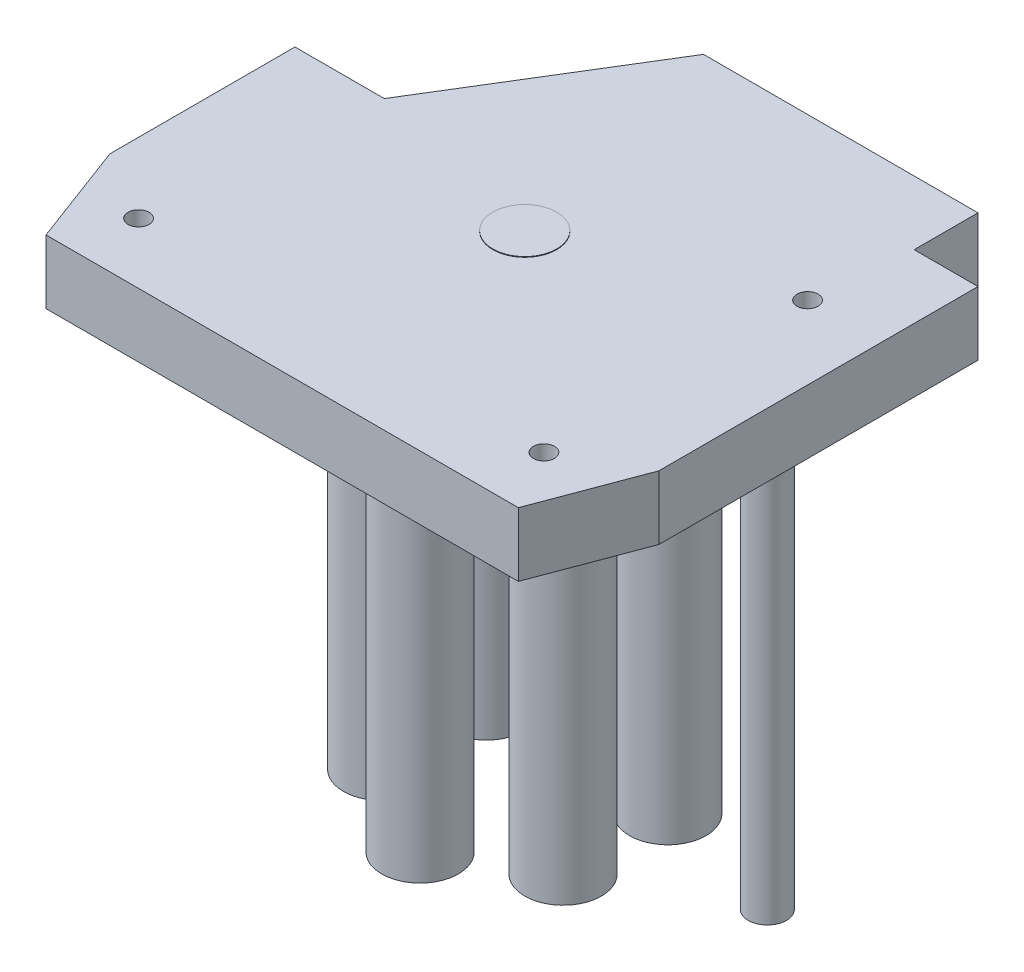
ISO-10303-21;
HEADER;
FILE_DESCRIPTION(('STEP AP214'),'2;1');
FILE_NAME('part.step','',(''),(''),'','','');
FILE_SCHEMA(('AUTOMOTIVE_DESIGN { 1 0 10303 214 1 1 1 1 }'));
ENDSEC;
DATA;
#1=APPLICATION_CONTEXT('core data for automotive mechanical design processes');
#2=APPLICATION_PROTOCOL_DEFINITION('international standard','automotive_design',2000,#1);
#3=PRODUCT_CONTEXT('',#1,'mechanical');
#4=PRODUCT('Part','Part','',(#3));
#5=PRODUCT_RELATED_PRODUCT_CATEGORY('part','',(#4));
#6=PRODUCT_DEFINITION_FORMATION('','',#4);
#7=PRODUCT_DEFINITION_CONTEXT('part definition',#1,'design');
#8=PRODUCT_DEFINITION('design','',#6,#7);
#9=PRODUCT_DEFINITION_SHAPE('','',#8);
#10=(LENGTH_UNIT() NAMED_UNIT(*) SI_UNIT(.MILLI.,.METRE.));
#11=(NAMED_UNIT(*) PLANE_ANGLE_UNIT() SI_UNIT($,.RADIAN.));
#12=(NAMED_UNIT(*) SI_UNIT($,.STERADIAN.) SOLID_ANGLE_UNIT());
#13=UNCERTAINTY_MEASURE_WITH_UNIT(LENGTH_MEASURE(1.E-05),#10,'distance_accuracy_value','');
#14=(GEOMETRIC_REPRESENTATION_CONTEXT(3) GLOBAL_UNCERTAINTY_ASSIGNED_CONTEXT((#13)) GLOBAL_UNIT_ASSIGNED_CONTEXT((#10,
#11,#12)) REPRESENTATION_CONTEXT('',''));
#15=CARTESIAN_POINT('',(0.,0.,0.));
#16=DIRECTION('',(0.,0.,1.));
#17=DIRECTION('',(1.,0.,0.));
#18=AXIS2_PLACEMENT_3D('',#15,#16,#17);
#19=CARTESIAN_POINT('',(14.,10.,0.));
#20=DIRECTION('',(0.,0.,1.));
#21=DIRECTION('',(1.,0.,0.));
#22=AXIS2_PLACEMENT_3D('',#19,#20,#21);
#23=PLANE('',#22);
#24=DIRECTION('',(-1.,0.,0.));
#25=VECTOR('',#24,1.);
#26=CARTESIAN_POINT('',(14.,0.,0.));
#27=LINE('',#26,#25);
#28=CARTESIAN_POINT('',(14.,0.,0.));
#29=VERTEX_POINT('',#28);
#30=CARTESIAN_POINT('',(0.,0.,0.));
#31=VERTEX_POINT('',#30);
#32=EDGE_CURVE('E224',#29,#31,#27,.T.);
#33=ORIENTED_EDGE('',*,*,#32,.T.);
#34=DIRECTION('',(0.,-1.,0.));
#35=VECTOR('',#34,1.);
#36=CARTESIAN_POINT('',(0.,10.,0.));
#37=LINE('',#36,#35);
#38=CARTESIAN_POINT('',(0.,10.,0.));
#39=VERTEX_POINT('',#38);
#40=EDGE_CURVE('E148',#39,#31,#37,.T.);
#41=ORIENTED_EDGE('',*,*,#40,.F.);
#42=DIRECTION('',(-1.,0.,0.));
#43=VECTOR('',#42,1.);
#44=CARTESIAN_POINT('',(14.,10.,0.));
#45=LINE('',#44,#43);
#46=CARTESIAN_POINT('',(14.,10.,0.));
#47=VERTEX_POINT('',#46);
#48=EDGE_CURVE('E135',#47,#39,#45,.T.);
#49=ORIENTED_EDGE('',*,*,#48,.F.);
#50=DIRECTION('',(0.,-1.,0.));
#51=VECTOR('',#50,1.);
#52=CARTESIAN_POINT('',(14.,10.,0.));
#53=LINE('',#52,#51);
#54=EDGE_CURVE('E142',#47,#29,#53,.T.);
#55=ORIENTED_EDGE('',*,*,#54,.T.);
#56=EDGE_LOOP('',(#33,#41,#49,#55));
#57=FACE_BOUND('',#56,.T.);
#58=ADVANCED_FACE('F33',(#57),#23,.F.);
#59=CARTESIAN_POINT('',(0.,10.,0.));
#60=DIRECTION('',(1.,0.,0.));
#61=DIRECTION('',(0.,0.,-1.));
#62=AXIS2_PLACEMENT_3D('',#59,#60,#61);
#63=PLANE('',#62);
#64=DIRECTION('',(0.,0.,1.));
#65=VECTOR('',#64,1.);
#66=CARTESIAN_POINT('',(0.,0.,0.));
#67=LINE('',#66,#65);
#68=CARTESIAN_POINT('',(0.,0.,28.9999999999999));
#69=VERTEX_POINT('',#68);
#70=EDGE_CURVE('E239',#31,#69,#67,.T.);
#71=ORIENTED_EDGE('',*,*,#70,.T.);
#72=DIRECTION('',(0.,1.,0.));
#73=VECTOR('',#72,1.);
#74=CARTESIAN_POINT('',(0.,10.,28.9999999999999));
#75=LINE('',#74,#73);
#76=CARTESIAN_POINT('',(0.,10.,28.9999999999999));
#77=VERTEX_POINT('',#76);
#78=EDGE_CURVE('E42',#69,#77,#75,.T.);
#79=ORIENTED_EDGE('',*,*,#78,.T.);
#80=DIRECTION('',(0.,0.,1.));
#81=VECTOR('',#80,1.);
#82=CARTESIAN_POINT('',(0.,10.,0.));
#83=LINE('',#82,#81);
#84=EDGE_CURVE('E228',#39,#77,#83,.T.);
#85=ORIENTED_EDGE('',*,*,#84,.F.);
#86=ORIENTED_EDGE('',*,*,#40,.T.);
#87=EDGE_LOOP('',(#71,#79,#85,#86));
#88=FACE_BOUND('',#87,.T.);
#89=ADVANCED_FACE('F267',(#88),#63,.F.);
#90=CARTESIAN_POINT('',(0.,10.,45.));
#91=DIRECTION('',(0.,0.,-1.));
#92=DIRECTION('',(-1.,0.,0.));
#93=AXIS2_PLACEMENT_3D('',#90,#91,#92);
#94=PLANE('',#93);
#95=DIRECTION('',(1.,0.,0.));
#96=VECTOR('',#95,1.);
#97=CARTESIAN_POINT('',(0.,10.,45.));
#98=LINE('',#97,#96);
#99=CARTESIAN_POINT('',(6.00000000000001,10.,45.));
#100=VERTEX_POINT('',#99);
#101=CARTESIAN_POINT('',(80.,10.,45.));
#102=VERTEX_POINT('',#101);
#103=EDGE_CURVE('E230',#100,#102,#98,.T.);
#104=ORIENTED_EDGE('',*,*,#103,.F.);
#105=DIRECTION('',(0.,-1.,0.));
#106=VECTOR('',#105,1.);
#107=CARTESIAN_POINT('',(6.00000000000001,10.,45.));
#108=LINE('',#107,#106);
#109=CARTESIAN_POINT('',(6.00000000000001,0.,45.));
#110=VERTEX_POINT('',#109);
#111=EDGE_CURVE('E162',#100,#110,#108,.T.);
#112=ORIENTED_EDGE('',*,*,#111,.T.);
#113=DIRECTION('',(1.,0.,0.));
#114=VECTOR('',#113,1.);
#115=CARTESIAN_POINT('',(0.,0.,45.));
#116=LINE('',#115,#114);
#117=CARTESIAN_POINT('',(80.,0.,45.));
#118=VERTEX_POINT('',#117);
#119=EDGE_CURVE('E138',#110,#118,#116,.T.);
#120=ORIENTED_EDGE('',*,*,#119,.T.);
#121=DIRECTION('',(0.,1.,0.));
#122=VECTOR('',#121,1.);
#123=CARTESIAN_POINT('',(80.,10.,45.));
#124=LINE('',#123,#122);
#125=EDGE_CURVE('E157',#118,#102,#124,.T.);
#126=ORIENTED_EDGE('',*,*,#125,.T.);
#127=EDGE_LOOP('',(#104,#112,#120,#126));
#128=FACE_BOUND('',#127,.T.);
#129=ADVANCED_FACE('F243',(#128),#94,.F.);
#130=CARTESIAN_POINT('',(86.,10.,45.));
#131=DIRECTION('',(-1.,0.,0.));
#132=DIRECTION('',(0.,0.,1.));
#133=AXIS2_PLACEMENT_3D('',#130,#131,#132);
#134=PLANE('',#133);
#135=DIRECTION('',(0.,0.,-1.));
#136=VECTOR('',#135,1.);
#137=CARTESIAN_POINT('',(86.,0.,45.));
#138=LINE('',#137,#136);
#139=CARTESIAN_POINT('',(86.,0.,28.9999999999998));
#140=VERTEX_POINT('',#139);
#141=CARTESIAN_POINT('',(86.,0.,-21.));
#142=VERTEX_POINT('',#141);
#143=EDGE_CURVE('E133',#140,#142,#138,.T.);
#144=ORIENTED_EDGE('',*,*,#143,.T.);
#145=DIRECTION('',(0.,1.,0.));
#146=VECTOR('',#145,1.);
#147=CARTESIAN_POINT('',(86.,0.,-21.));
#148=LINE('',#147,#146);
#149=CARTESIAN_POINT('',(86.,10.,-21.));
#150=VERTEX_POINT('',#149);
#151=EDGE_CURVE('E221',#142,#150,#148,.T.);
#152=ORIENTED_EDGE('',*,*,#151,.T.);
#153=DIRECTION('',(0.,0.,-1.));
#154=VECTOR('',#153,1.);
#155=CARTESIAN_POINT('',(86.,10.,45.));
#156=LINE('',#155,#154);
#157=CARTESIAN_POINT('',(86.,10.,28.9999999999998));
#158=VERTEX_POINT('',#157);
#159=EDGE_CURVE('E232',#158,#150,#156,.T.);
#160=ORIENTED_EDGE('',*,*,#159,.F.);
#161=DIRECTION('',(0.,-1.,0.));
#162=VECTOR('',#161,1.);
#163=CARTESIAN_POINT('',(86.,10.,28.9999999999998));
#164=LINE('',#163,#162);
#165=EDGE_CURVE('E151',#158,#140,#164,.T.);
#166=ORIENTED_EDGE('',*,*,#165,.T.);
#167=EDGE_LOOP('',(#144,#152,#160,#166));
#168=FACE_BOUND('',#167,.T.);
#169=ADVANCED_FACE('F256',(#168),#134,.F.);
#170=CARTESIAN_POINT('',(86.,10.,-31.));
#171=DIRECTION('',(0.,0.,1.));
#172=DIRECTION('',(1.,0.,0.));
#173=AXIS2_PLACEMENT_3D('',#170,#171,#172);
#174=PLANE('',#173);
#175=CARTESIAN_POINT('',(43.,5.,-31.));
#176=DIRECTION('',(0.,0.,-1.));
#177=DIRECTION('',(-1.,0.,0.));
#178=AXIS2_PLACEMENT_3D('',#175,#176,#177);
#179=CIRCLE('',#178,1.65);
#180=CARTESIAN_POINT('',(41.35,5.,-31.));
#181=VERTEX_POINT('',#180);
#182=EDGE_CURVE('E579',#181,#181,#179,.T.);
#183=ORIENTED_EDGE('',*,*,#182,.F.);
#184=EDGE_LOOP('',(#183));
#185=FACE_BOUND('',#184,.T.);
#186=DIRECTION('',(-1.,0.,0.));
#187=VECTOR('',#186,1.);
#188=CARTESIAN_POINT('',(86.,10.,-31.));
#189=LINE('',#188,#187);
#190=CARTESIAN_POINT('',(76.,10.,-31.));
#191=VERTEX_POINT('',#190);
#192=CARTESIAN_POINT('',(33.,10.,-31.));
#193=VERTEX_POINT('',#192);
#194=EDGE_CURVE('E127',#191,#193,#189,.T.);
#195=ORIENTED_EDGE('',*,*,#194,.F.);
#196=DIRECTION('',(0.,1.,0.));
#197=VECTOR('',#196,1.);
#198=CARTESIAN_POINT('',(76.,0.,-31.));
#199=LINE('',#198,#197);
#200=CARTESIAN_POINT('',(76.,0.,-31.));
#201=VERTEX_POINT('',#200);
#202=EDGE_CURVE('E114',#201,#191,#199,.T.);
#203=ORIENTED_EDGE('',*,*,#202,.F.);
#204=DIRECTION('',(-1.,0.,0.));
#205=VECTOR('',#204,1.);
#206=CARTESIAN_POINT('',(86.,0.,-31.));
#207=LINE('',#206,#205);
#208=CARTESIAN_POINT('',(33.,0.,-31.));
#209=VERTEX_POINT('',#208);
#210=EDGE_CURVE('E125',#201,#209,#207,.T.);
#211=ORIENTED_EDGE('',*,*,#210,.T.);
#212=DIRECTION('',(0.,-1.,0.));
#213=VECTOR('',#212,1.);
#214=CARTESIAN_POINT('',(33.,10.,-31.));
#215=LINE('',#214,#213);
#216=EDGE_CURVE('E145',#193,#209,#215,.T.);
#217=ORIENTED_EDGE('',*,*,#216,.F.);
#218=EDGE_LOOP('',(#195,#203,#211,#217));
#219=FACE_BOUND('',#218,.T.);
#220=ADVANCED_FACE('F123',(#185,#219),#174,.F.);
#221=CARTESIAN_POINT('',(33.,10.,-31.));
#222=DIRECTION('',(0.852601252410943,0.,0.522562057929287));
#223=DIRECTION('',(0.522562057929287,0.,-0.852601252410943));
#224=AXIS2_PLACEMENT_3D('',#221,#222,#223);
#225=PLANE('',#224);
#226=DIRECTION('',(-0.522562057929287,0.,0.852601252410943));
#227=VECTOR('',#226,1.);
#228=CARTESIAN_POINT('',(33.,0.,-31.));
#229=LINE('',#228,#227);
#230=EDGE_CURVE('E132',#209,#29,#229,.T.);
#231=ORIENTED_EDGE('',*,*,#230,.T.);
#232=ORIENTED_EDGE('',*,*,#54,.F.);
#233=DIRECTION('',(-0.522562057929287,0.,0.852601252410943));
#234=VECTOR('',#233,1.);
#235=CARTESIAN_POINT('',(33.,10.,-31.));
#236=LINE('',#235,#234);
#237=EDGE_CURVE('E146',#193,#47,#236,.T.);
#238=ORIENTED_EDGE('',*,*,#237,.F.);
#239=ORIENTED_EDGE('',*,*,#216,.T.);
#240=EDGE_LOOP('',(#231,#232,#238,#239));
#241=FACE_BOUND('',#240,.T.);
#242=ADVANCED_FACE('F261',(#241),#225,.F.);
#243=CARTESIAN_POINT('',(0.,10.,0.));
#244=DIRECTION('',(0.,1.,0.));
#245=DIRECTION('',(0.,0.,1.));
#246=AXIS2_PLACEMENT_3D('',#243,#244,#245);
#247=PLANE('',#246);
#248=CARTESIAN_POINT('',(74.5,10.,35.5));
#249=DIRECTION('',(0.,1.,0.));
#250=DIRECTION('',(0.,0.,1.));
#251=AXIS2_PLACEMENT_3D('',#248,#249,#250);
#252=CIRCLE('',#251,1.65);
#253=CARTESIAN_POINT('',(74.5,10.,37.15));
#254=VERTEX_POINT('',#253);
#255=EDGE_CURVE('E564',#254,#254,#252,.T.);
#256=ORIENTED_EDGE('',*,*,#255,.F.);
#257=EDGE_LOOP('',(#256));
#258=FACE_BOUND('',#257,.T.);
#259=CARTESIAN_POINT('',(11.,10.,35.5));
#260=DIRECTION('',(0.,1.,0.));
#261=DIRECTION('',(0.,0.,1.));
#262=AXIS2_PLACEMENT_3D('',#259,#260,#261);
#263=CIRCLE('',#262,1.65);
#264=CARTESIAN_POINT('',(11.,10.,37.15));
#265=VERTEX_POINT('',#264);
#266=EDGE_CURVE('E567',#265,#265,#263,.T.);
#267=ORIENTED_EDGE('',*,*,#266,.F.);
#268=EDGE_LOOP('',(#267));
#269=FACE_BOUND('',#268,.T.);
#270=CARTESIAN_POINT('',(74.5,10.,-5.8));
#271=DIRECTION('',(0.,1.,0.));
#272=DIRECTION('',(0.,0.,1.));
#273=AXIS2_PLACEMENT_3D('',#270,#271,#272);
#274=CIRCLE('',#273,1.65);
#275=CARTESIAN_POINT('',(74.5,10.,-4.15));
#276=VERTEX_POINT('',#275);
#277=EDGE_CURVE('E559',#276,#276,#274,.T.);
#278=ORIENTED_EDGE('',*,*,#277,.F.);
#279=EDGE_LOOP('',(#278));
#280=FACE_BOUND('',#279,.T.);
#281=CARTESIAN_POINT('',(43.,10.,7.));
#282=DIRECTION('',(0.,1.,0.));
#283=DIRECTION('',(0.,0.,1.));
#284=AXIS2_PLACEMENT_3D('',#281,#282,#283);
#285=CIRCLE('',#284,5.);
#286=CARTESIAN_POINT('',(43.,10.,12.));
#287=VERTEX_POINT('',#286);
#288=EDGE_CURVE('E171',#287,#287,#285,.T.);
#289=ORIENTED_EDGE('',*,*,#288,.F.);
#290=EDGE_LOOP('',(#289));
#291=FACE_BOUND('',#290,.T.);
#292=DIRECTION('',(1.,0.,0.));
#293=VECTOR('',#292,1.);
#294=CARTESIAN_POINT('',(86.,10.,-21.));
#295=LINE('',#294,#293);
#296=CARTESIAN_POINT('',(76.,10.,-21.));
#297=VERTEX_POINT('',#296);
#298=EDGE_CURVE('E119',#297,#150,#295,.T.);
#299=ORIENTED_EDGE('',*,*,#298,.F.);
#300=DIRECTION('',(0.,0.,1.));
#301=VECTOR('',#300,1.);
#302=CARTESIAN_POINT('',(76.,10.,-31.));
#303=LINE('',#302,#301);
#304=EDGE_CURVE('E215',#191,#297,#303,.T.);
#305=ORIENTED_EDGE('',*,*,#304,.F.);
#306=ORIENTED_EDGE('',*,*,#194,.T.);
#307=ORIENTED_EDGE('',*,*,#237,.T.);
#308=ORIENTED_EDGE('',*,*,#48,.T.);
#309=ORIENTED_EDGE('',*,*,#84,.T.);
#310=DIRECTION('',(-0.351123441588389,0.,-0.936329177569045));
#311=VECTOR('',#310,1.);
#312=CARTESIAN_POINT('',(-9.53424657534236,10.,3.57534246575336));
#313=LINE('',#312,#311);
#314=EDGE_CURVE('E11',#77,#100,#313,.F.);
#315=ORIENTED_EDGE('',*,*,#314,.T.);
#316=ORIENTED_EDGE('',*,*,#103,.T.);
#317=DIRECTION('',(-0.351123441588389,0.,0.936329177569046));
#318=VECTOR('',#317,1.);
#319=CARTESIAN_POINT('',(84.9315068493151,10.,31.8493150684929));
#320=LINE('',#319,#318);
#321=EDGE_CURVE('E160',#102,#158,#320,.F.);
#322=ORIENTED_EDGE('',*,*,#321,.T.);
#323=ORIENTED_EDGE('',*,*,#159,.T.);
#324=EDGE_LOOP('',(#299,#305,#306,#307,#308,#309,#315,#316,#322,#323));
#325=FACE_BOUND('',#324,.T.);
#326=ADVANCED_FACE('F254',(#258,#269,#280,#291,#325),#247,.T.);
#327=CARTESIAN_POINT('',(0.,0.,0.));
#328=DIRECTION('',(0.,1.,0.));
#329=DIRECTION('',(0.,0.,1.));
#330=AXIS2_PLACEMENT_3D('',#327,#328,#329);
#331=PLANE('',#330);
#332=CARTESIAN_POINT('',(74.5,0.,35.5));
#333=DIRECTION('',(0.,-1.,0.));
#334=DIRECTION('',(0.,0.,-1.));
#335=AXIS2_PLACEMENT_3D('',#332,#333,#334);
#336=CIRCLE('',#335,1.65);
#337=CARTESIAN_POINT('',(74.5,0.,33.85));
#338=VERTEX_POINT('',#337);
#339=EDGE_CURVE('E572',#338,#338,#336,.T.);
#340=ORIENTED_EDGE('',*,*,#339,.F.);
#341=EDGE_LOOP('',(#340));
#342=FACE_BOUND('',#341,.T.);
#343=CARTESIAN_POINT('',(11.,0.,35.5));
#344=DIRECTION('',(0.,-1.,0.));
#345=DIRECTION('',(0.,0.,-1.));
#346=AXIS2_PLACEMENT_3D('',#343,#344,#345);
#347=CIRCLE('',#346,1.65);
#348=CARTESIAN_POINT('',(11.,0.,33.85));
#349=VERTEX_POINT('',#348);
#350=EDGE_CURVE('E573',#349,#349,#347,.T.);
#351=ORIENTED_EDGE('',*,*,#350,.F.);
#352=EDGE_LOOP('',(#351));
#353=FACE_BOUND('',#352,.T.);
#354=CARTESIAN_POINT('',(74.5,0.,-5.8));
#355=DIRECTION('',(0.,-1.,0.));
#356=DIRECTION('',(0.,0.,-1.));
#357=AXIS2_PLACEMENT_3D('',#354,#355,#356);
#358=CIRCLE('',#357,1.65);
#359=CARTESIAN_POINT('',(74.5,0.,-7.45));
#360=VERTEX_POINT('',#359);
#361=EDGE_CURVE('E562',#360,#360,#358,.T.);
#362=ORIENTED_EDGE('',*,*,#361,.F.);
#363=EDGE_LOOP('',(#362));
#364=FACE_BOUND('',#363,.T.);
#365=CARTESIAN_POINT('',(78.,0.,4.));
#366=DIRECTION('',(0.,1.,0.));
#367=DIRECTION('',(0.,0.,1.));
#368=AXIS2_PLACEMENT_3D('',#365,#366,#367);
#369=CIRCLE('',#368,3.00000000000001);
#370=CARTESIAN_POINT('',(78.,0.,7.00000000000001));
#371=VERTEX_POINT('',#370);
#372=EDGE_CURVE('E37',#371,#371,#369,.T.);
#373=ORIENTED_EDGE('',*,*,#372,.T.);
#374=EDGE_LOOP('',(#373));
#375=FACE_BOUND('',#374,.T.);
#376=CARTESIAN_POINT('',(28.7971833779353,0.,-1.19999999999975));
#377=DIRECTION('',(0.,1.,0.));
#378=DIRECTION('',(0.,0.,1.));
#379=AXIS2_PLACEMENT_3D('',#376,#377,#378);
#380=CIRCLE('',#379,6.);
#381=CARTESIAN_POINT('',(28.7971833779353,0.,4.80000000000025));
#382=VERTEX_POINT('',#381);
#383=EDGE_CURVE('E188',#382,#382,#380,.T.);
#384=ORIENTED_EDGE('',*,*,#383,.T.);
#385=EDGE_LOOP('',(#384));
#386=FACE_BOUND('',#385,.T.);
#387=CARTESIAN_POINT('',(28.7971833779356,0.,15.2000000000002));
#388=DIRECTION('',(0.,1.,0.));
#389=DIRECTION('',(0.,0.,1.));
#390=AXIS2_PLACEMENT_3D('',#387,#388,#389);
#391=CIRCLE('',#390,6.);
#392=CARTESIAN_POINT('',(28.7971833779356,0.,21.2000000000002));
#393=VERTEX_POINT('',#392);
#394=EDGE_CURVE('E185',#393,#393,#391,.T.);
#395=ORIENTED_EDGE('',*,*,#394,.T.);
#396=EDGE_LOOP('',(#395));
#397=FACE_BOUND('',#396,.T.);
#398=CARTESIAN_POINT('',(43.0000000000005,0.,23.4));
#399=DIRECTION('',(0.,1.,0.));
#400=DIRECTION('',(0.,0.,1.));
#401=AXIS2_PLACEMENT_3D('',#398,#399,#400);
#402=CIRCLE('',#401,6.);
#403=CARTESIAN_POINT('',(43.0000000000005,0.,29.4));
#404=VERTEX_POINT('',#403);
#405=EDGE_CURVE('E181',#404,#404,#402,.T.);
#406=ORIENTED_EDGE('',*,*,#405,.T.);
#407=EDGE_LOOP('',(#406));
#408=FACE_BOUND('',#407,.T.);
#409=CARTESIAN_POINT('',(57.2028166220652,0.,15.1999999999998));
#410=DIRECTION('',(0.,1.,0.));
#411=DIRECTION('',(0.,0.,1.));
#412=AXIS2_PLACEMENT_3D('',#409,#410,#411);
#413=CIRCLE('',#412,6.);
#414=CARTESIAN_POINT('',(57.2028166220652,0.,21.1999999999998));
#415=VERTEX_POINT('',#414);
#416=EDGE_CURVE('E177',#415,#415,#413,.T.);
#417=ORIENTED_EDGE('',*,*,#416,.T.);
#418=EDGE_LOOP('',(#417));
#419=FACE_BOUND('',#418,.T.);
#420=CARTESIAN_POINT('',(57.2028166220649,0.,-1.20000000000024));
#421=DIRECTION('',(0.,1.,0.));
#422=DIRECTION('',(0.,0.,1.));
#423=AXIS2_PLACEMENT_3D('',#420,#421,#422);
#424=CIRCLE('',#423,6.);
#425=CARTESIAN_POINT('',(57.2028166220649,0.,4.79999999999976));
#426=VERTEX_POINT('',#425);
#427=EDGE_CURVE('E173',#426,#426,#424,.T.);
#428=ORIENTED_EDGE('',*,*,#427,.T.);
#429=EDGE_LOOP('',(#428));
#430=FACE_BOUND('',#429,.T.);
#431=CARTESIAN_POINT('',(43.,0.,-9.4));
#432=DIRECTION('',(0.,1.,0.));
#433=DIRECTION('',(0.,0.,1.));
#434=AXIS2_PLACEMENT_3D('',#431,#432,#433);
#435=CIRCLE('',#434,6.);
#436=CARTESIAN_POINT('',(43.,0.,-3.4));
#437=VERTEX_POINT('',#436);
#438=EDGE_CURVE('E168',#437,#437,#435,.T.);
#439=ORIENTED_EDGE('',*,*,#438,.T.);
#440=EDGE_LOOP('',(#439));
#441=FACE_BOUND('',#440,.T.);
#442=DIRECTION('',(0.,0.,1.));
#443=VECTOR('',#442,1.);
#444=CARTESIAN_POINT('',(76.,0.,-31.));
#445=LINE('',#444,#443);
#446=CARTESIAN_POINT('',(76.,0.,-21.));
#447=VERTEX_POINT('',#446);
#448=EDGE_CURVE('E110',#201,#447,#445,.T.);
#449=ORIENTED_EDGE('',*,*,#448,.T.);
#450=DIRECTION('',(1.,0.,0.));
#451=VECTOR('',#450,1.);
#452=CARTESIAN_POINT('',(86.,0.,-21.));
#453=LINE('',#452,#451);
#454=EDGE_CURVE('E50',#447,#142,#453,.T.);
#455=ORIENTED_EDGE('',*,*,#454,.T.);
#456=ORIENTED_EDGE('',*,*,#143,.F.);
#457=DIRECTION('',(0.351123441588389,0.,-0.936329177569046));
#458=VECTOR('',#457,1.);
#459=CARTESIAN_POINT('',(86.,0.,28.9999999999998));
#460=LINE('',#459,#458);
#461=EDGE_CURVE('E154',#140,#118,#460,.F.);
#462=ORIENTED_EDGE('',*,*,#461,.T.);
#463=ORIENTED_EDGE('',*,*,#119,.F.);
#464=DIRECTION('',(0.351123441588389,0.,0.936329177569045));
#465=VECTOR('',#464,1.);
#466=CARTESIAN_POINT('',(6.00000000000001,0.,45.));
#467=LINE('',#466,#465);
#468=EDGE_CURVE('E165',#110,#69,#467,.F.);
#469=ORIENTED_EDGE('',*,*,#468,.T.);
#470=ORIENTED_EDGE('',*,*,#70,.F.);
#471=ORIENTED_EDGE('',*,*,#32,.F.);
#472=ORIENTED_EDGE('',*,*,#230,.F.);
#473=ORIENTED_EDGE('',*,*,#210,.F.);
#474=EDGE_LOOP('',(#449,#455,#456,#462,#463,#469,#470,#471,#472,#473));
#475=FACE_BOUND('',#474,.T.);
#476=ADVANCED_FACE('F130',(#342,#353,#364,#375,#386,#397,#408,#419,#430,#441,#475),#331,.F.);
#477=CARTESIAN_POINT('',(86.,10.,28.9999999999998));
#478=DIRECTION('',(-0.936329177569045,0.,-0.351123441588389));
#479=DIRECTION('',(0.,-1.,0.));
#480=AXIS2_PLACEMENT_3D('',#477,#478,#479);
#481=PLANE('',#480);
#482=ORIENTED_EDGE('',*,*,#321,.F.);
#483=ORIENTED_EDGE('',*,*,#125,.F.);
#484=ORIENTED_EDGE('',*,*,#461,.F.);
#485=ORIENTED_EDGE('',*,*,#165,.F.);
#486=EDGE_LOOP('',(#482,#483,#484,#485));
#487=FACE_BOUND('',#486,.T.);
#488=ADVANCED_FACE('F250',(#487),#481,.F.);
#489=CARTESIAN_POINT('',(6.00000000000001,10.,45.));
#490=DIRECTION('',(0.936329177569045,0.,-0.351123441588389));
#491=DIRECTION('',(0.,-1.,0.));
#492=AXIS2_PLACEMENT_3D('',#489,#490,#491);
#493=PLANE('',#492);
#494=ORIENTED_EDGE('',*,*,#314,.F.);
#495=ORIENTED_EDGE('',*,*,#78,.F.);
#496=ORIENTED_EDGE('',*,*,#468,.F.);
#497=ORIENTED_EDGE('',*,*,#111,.F.);
#498=EDGE_LOOP('',(#494,#495,#496,#497));
#499=FACE_BOUND('',#498,.T.);
#500=ADVANCED_FACE('F35',(#499),#493,.F.);
#501=CARTESIAN_POINT('',(86.,0.,-21.));
#502=DIRECTION('',(0.,0.,1.));
#503=DIRECTION('',(1.,0.,0.));
#504=AXIS2_PLACEMENT_3D('',#501,#502,#503);
#505=PLANE('',#504);
#506=ORIENTED_EDGE('',*,*,#298,.T.);
#507=ORIENTED_EDGE('',*,*,#151,.F.);
#508=ORIENTED_EDGE('',*,*,#454,.F.);
#509=DIRECTION('',(0.,1.,0.));
#510=VECTOR('',#509,1.);
#511=CARTESIAN_POINT('',(76.,0.,-21.));
#512=LINE('',#511,#510);
#513=EDGE_CURVE('E116',#447,#297,#512,.T.);
#514=ORIENTED_EDGE('',*,*,#513,.T.);
#515=EDGE_LOOP('',(#506,#507,#508,#514));
#516=FACE_BOUND('',#515,.T.);
#517=ADVANCED_FACE('F257',(#516),#505,.F.);
#518=CARTESIAN_POINT('',(76.,0.,-31.));
#519=DIRECTION('',(-1.,0.,0.));
#520=DIRECTION('',(0.,0.,1.));
#521=AXIS2_PLACEMENT_3D('',#518,#519,#520);
#522=PLANE('',#521);
#523=ORIENTED_EDGE('',*,*,#304,.T.);
#524=ORIENTED_EDGE('',*,*,#513,.F.);
#525=ORIENTED_EDGE('',*,*,#448,.F.);
#526=ORIENTED_EDGE('',*,*,#202,.T.);
#527=EDGE_LOOP('',(#523,#524,#525,#526));
#528=FACE_BOUND('',#527,.T.);
#529=ADVANCED_FACE('F113',(#528),#522,.F.);
#530=CARTESIAN_POINT('',(43.,10.1,7.));
#531=DIRECTION('',(0.,-1.,0.));
#532=DIRECTION('',(0.,0.,-1.));
#533=AXIS2_PLACEMENT_3D('',#530,#531,#532);
#534=CYLINDRICAL_SURFACE('',#533,5.);
#535=ORIENTED_EDGE('',*,*,#288,.T.);
#536=EDGE_LOOP('',(#535));
#537=FACE_BOUND('',#536,.T.);
#538=CARTESIAN_POINT('',(43.,10.1,7.));
#539=DIRECTION('',(0.,1.,0.));
#540=DIRECTION('',(0.,0.,1.));
#541=AXIS2_PLACEMENT_3D('',#538,#539,#540);
#542=CIRCLE('',#541,5.);
#543=CARTESIAN_POINT('',(43.,10.1,12.));
#544=VERTEX_POINT('',#543);
#545=EDGE_CURVE('E212',#544,#544,#542,.T.);
#546=ORIENTED_EDGE('',*,*,#545,.F.);
#547=EDGE_LOOP('',(#546));
#548=FACE_BOUND('',#547,.T.);
#549=ADVANCED_FACE('F322',(#537,#548),#534,.T.);
#550=CARTESIAN_POINT('',(43.,10.1,7.));
#551=DIRECTION('',(0.,1.,0.));
#552=DIRECTION('',(0.,0.,1.));
#553=AXIS2_PLACEMENT_3D('',#550,#551,#552);
#554=PLANE('',#553);
#555=ORIENTED_EDGE('',*,*,#545,.T.);
#556=EDGE_LOOP('',(#555));
#557=FACE_BOUND('',#556,.T.);
#558=ADVANCED_FACE('F331',(#557),#554,.T.);
#559=CARTESIAN_POINT('',(43.,-82.9705627484772,-9.4));
#560=DIRECTION('',(0.,1.,0.));
#561=DIRECTION('',(0.,0.,1.));
#562=AXIS2_PLACEMENT_3D('',#559,#560,#561);
#563=CYLINDRICAL_SURFACE('',#562,6.);
#564=CARTESIAN_POINT('',(43.,-66.,-9.4));
#565=DIRECTION('',(0.,1.,0.));
#566=DIRECTION('',(0.,0.,1.));
#567=AXIS2_PLACEMENT_3D('',#564,#565,#566);
#568=CIRCLE('',#567,6.);
#569=CARTESIAN_POINT('',(43.,-66.,-3.4));
#570=VERTEX_POINT('',#569);
#571=EDGE_CURVE('E172',#570,#570,#568,.F.);
#572=ORIENTED_EDGE('',*,*,#571,.F.);
#573=EDGE_LOOP('',(#572));
#574=FACE_BOUND('',#573,.T.);
#575=ORIENTED_EDGE('',*,*,#438,.F.);
#576=EDGE_LOOP('',(#575));
#577=FACE_BOUND('',#576,.T.);
#578=ADVANCED_FACE('F341',(#574,#577),#563,.T.);
#579=CARTESIAN_POINT('',(0.,-66.,0.));
#580=DIRECTION('',(0.,1.,0.));
#581=DIRECTION('',(0.,0.,1.));
#582=AXIS2_PLACEMENT_3D('',#579,#580,#581);
#583=PLANE('',#582);
#584=ORIENTED_EDGE('',*,*,#571,.T.);
#585=EDGE_LOOP('',(#584));
#586=FACE_BOUND('',#585,.T.);
#587=ADVANCED_FACE('F351',(#586),#583,.F.);
#588=CARTESIAN_POINT('',(57.2028166220649,-82.9705627484772,-1.20000000000024));
#589=DIRECTION('',(0.,1.,0.));
#590=DIRECTION('',(0.,0.,1.));
#591=AXIS2_PLACEMENT_3D('',#588,#589,#590);
#592=CYLINDRICAL_SURFACE('',#591,6.);
#593=CARTESIAN_POINT('',(57.2028166220649,-66.,-1.20000000000024));
#594=DIRECTION('',(0.,1.,0.));
#595=DIRECTION('',(0.,0.,1.));
#596=AXIS2_PLACEMENT_3D('',#593,#594,#595);
#597=CIRCLE('',#596,6.);
#598=CARTESIAN_POINT('',(57.2028166220649,-66.,4.79999999999976));
#599=VERTEX_POINT('',#598);
#600=EDGE_CURVE('E176',#599,#599,#597,.F.);
#601=ORIENTED_EDGE('',*,*,#600,.F.);
#602=EDGE_LOOP('',(#601));
#603=FACE_BOUND('',#602,.T.);
#604=ORIENTED_EDGE('',*,*,#427,.F.);
#605=EDGE_LOOP('',(#604));
#606=FACE_BOUND('',#605,.T.);
#607=ADVANCED_FACE('F361',(#603,#606),#592,.T.);
#608=CARTESIAN_POINT('',(0.,-66.,0.));
#609=DIRECTION('',(0.,1.,0.));
#610=DIRECTION('',(0.,0.,1.));
#611=AXIS2_PLACEMENT_3D('',#608,#609,#610);
#612=PLANE('',#611);
#613=ORIENTED_EDGE('',*,*,#600,.T.);
#614=EDGE_LOOP('',(#613));
#615=FACE_BOUND('',#614,.T.);
#616=ADVANCED_FACE('F370',(#615),#612,.F.);
#617=CARTESIAN_POINT('',(57.2028166220652,-82.9705627484772,15.1999999999998));
#618=DIRECTION('',(0.,1.,0.));
#619=DIRECTION('',(0.,0.,1.));
#620=AXIS2_PLACEMENT_3D('',#617,#618,#619);
#621=CYLINDRICAL_SURFACE('',#620,6.);
#622=CARTESIAN_POINT('',(57.2028166220652,-66.,15.1999999999998));
#623=DIRECTION('',(0.,1.,0.));
#624=DIRECTION('',(0.,0.,1.));
#625=AXIS2_PLACEMENT_3D('',#622,#623,#624);
#626=CIRCLE('',#625,6.);
#627=CARTESIAN_POINT('',(57.2028166220652,-66.,21.1999999999998));
#628=VERTEX_POINT('',#627);
#629=EDGE_CURVE('E180',#628,#628,#626,.F.);
#630=ORIENTED_EDGE('',*,*,#629,.F.);
#631=EDGE_LOOP('',(#630));
#632=FACE_BOUND('',#631,.T.);
#633=ORIENTED_EDGE('',*,*,#416,.F.);
#634=EDGE_LOOP('',(#633));
#635=FACE_BOUND('',#634,.T.);
#636=ADVANCED_FACE('F380',(#632,#635),#621,.T.);
#637=CARTESIAN_POINT('',(0.,-66.,0.));
#638=DIRECTION('',(0.,1.,0.));
#639=DIRECTION('',(0.,0.,1.));
#640=AXIS2_PLACEMENT_3D('',#637,#638,#639);
#641=PLANE('',#640);
#642=ORIENTED_EDGE('',*,*,#629,.T.);
#643=EDGE_LOOP('',(#642));
#644=FACE_BOUND('',#643,.T.);
#645=ADVANCED_FACE('F389',(#644),#641,.F.);
#646=CARTESIAN_POINT('',(43.0000000000005,-82.9705627484772,23.4));
#647=DIRECTION('',(0.,1.,0.));
#648=DIRECTION('',(0.,0.,1.));
#649=AXIS2_PLACEMENT_3D('',#646,#647,#648);
#650=CYLINDRICAL_SURFACE('',#649,6.);
#651=CARTESIAN_POINT('',(43.0000000000005,-66.,23.4));
#652=DIRECTION('',(0.,1.,0.));
#653=DIRECTION('',(0.,0.,1.));
#654=AXIS2_PLACEMENT_3D('',#651,#652,#653);
#655=CIRCLE('',#654,6.);
#656=CARTESIAN_POINT('',(43.0000000000005,-66.,29.4));
#657=VERTEX_POINT('',#656);
#658=EDGE_CURVE('E184',#657,#657,#655,.F.);
#659=ORIENTED_EDGE('',*,*,#658,.F.);
#660=EDGE_LOOP('',(#659));
#661=FACE_BOUND('',#660,.T.);
#662=ORIENTED_EDGE('',*,*,#405,.F.);
#663=EDGE_LOOP('',(#662));
#664=FACE_BOUND('',#663,.T.);
#665=ADVANCED_FACE('F399',(#661,#664),#650,.T.);
#666=CARTESIAN_POINT('',(0.,-66.,0.));
#667=DIRECTION('',(0.,1.,0.));
#668=DIRECTION('',(0.,0.,1.));
#669=AXIS2_PLACEMENT_3D('',#666,#667,#668);
#670=PLANE('',#669);
#671=ORIENTED_EDGE('',*,*,#658,.T.);
#672=EDGE_LOOP('',(#671));
#673=FACE_BOUND('',#672,.T.);
#674=ADVANCED_FACE('F408',(#673),#670,.F.);
#675=CARTESIAN_POINT('',(28.7971833779356,-82.9705627484772,15.2000000000002));
#676=DIRECTION('',(0.,1.,0.));
#677=DIRECTION('',(0.,0.,1.));
#678=AXIS2_PLACEMENT_3D('',#675,#676,#677);
#679=CYLINDRICAL_SURFACE('',#678,6.);
#680=CARTESIAN_POINT('',(28.7971833779356,-66.,15.2000000000002));
#681=DIRECTION('',(0.,1.,0.));
#682=DIRECTION('',(0.,0.,1.));
#683=AXIS2_PLACEMENT_3D('',#680,#681,#682);
#684=CIRCLE('',#683,6.);
#685=CARTESIAN_POINT('',(28.7971833779356,-66.,21.2000000000002));
#686=VERTEX_POINT('',#685);
#687=EDGE_CURVE('E187',#686,#686,#684,.F.);
#688=ORIENTED_EDGE('',*,*,#687,.F.);
#689=EDGE_LOOP('',(#688));
#690=FACE_BOUND('',#689,.T.);
#691=ORIENTED_EDGE('',*,*,#394,.F.);
#692=EDGE_LOOP('',(#691));
#693=FACE_BOUND('',#692,.T.);
#694=ADVANCED_FACE('F418',(#690,#693),#679,.T.);
#695=CARTESIAN_POINT('',(0.,-66.,0.));
#696=DIRECTION('',(0.,1.,0.));
#697=DIRECTION('',(0.,0.,1.));
#698=AXIS2_PLACEMENT_3D('',#695,#696,#697);
#699=PLANE('',#698);
#700=ORIENTED_EDGE('',*,*,#687,.T.);
#701=EDGE_LOOP('',(#700));
#702=FACE_BOUND('',#701,.T.);
#703=ADVANCED_FACE('F428',(#702),#699,.F.);
#704=CARTESIAN_POINT('',(28.7971833779353,-82.9705627484772,-1.19999999999975));
#705=DIRECTION('',(0.,1.,0.));
#706=DIRECTION('',(0.,0.,1.));
#707=AXIS2_PLACEMENT_3D('',#704,#705,#706);
#708=CYLINDRICAL_SURFACE('',#707,6.);
#709=CARTESIAN_POINT('',(28.7971833779353,-66.,-1.19999999999975));
#710=DIRECTION('',(0.,1.,0.));
#711=DIRECTION('',(0.,0.,1.));
#712=AXIS2_PLACEMENT_3D('',#709,#710,#711);
#713=CIRCLE('',#712,6.);
#714=CARTESIAN_POINT('',(28.7971833779353,-66.,4.80000000000025));
#715=VERTEX_POINT('',#714);
#716=EDGE_CURVE('E190',#715,#715,#713,.F.);
#717=ORIENTED_EDGE('',*,*,#716,.F.);
#718=EDGE_LOOP('',(#717));
#719=FACE_BOUND('',#718,.T.);
#720=ORIENTED_EDGE('',*,*,#383,.F.);
#721=EDGE_LOOP('',(#720));
#722=FACE_BOUND('',#721,.T.);
#723=ADVANCED_FACE('F438',(#719,#722),#708,.T.);
#724=CARTESIAN_POINT('',(0.,-66.,0.));
#725=DIRECTION('',(0.,1.,0.));
#726=DIRECTION('',(0.,0.,1.));
#727=AXIS2_PLACEMENT_3D('',#724,#725,#726);
#728=PLANE('',#727);
#729=ORIENTED_EDGE('',*,*,#716,.T.);
#730=EDGE_LOOP('',(#729));
#731=FACE_BOUND('',#730,.T.);
#732=ADVANCED_FACE('F447',(#731),#728,.F.);
#733=CARTESIAN_POINT('',(78.,-74.4852813742386,4.));
#734=DIRECTION('',(0.,1.,0.));
#735=DIRECTION('',(0.,0.,1.));
#736=AXIS2_PLACEMENT_3D('',#733,#734,#735);
#737=CYLINDRICAL_SURFACE('',#736,3.00000000000001);
#738=CARTESIAN_POINT('',(78.,-66.,4.));
#739=DIRECTION('',(0.,1.,0.));
#740=DIRECTION('',(0.,0.,1.));
#741=AXIS2_PLACEMENT_3D('',#738,#739,#740);
#742=CIRCLE('',#741,3.00000000000001);
#743=CARTESIAN_POINT('',(78.,-66.,7.00000000000001));
#744=VERTEX_POINT('',#743);
#745=EDGE_CURVE('E200',#744,#744,#742,.F.);
#746=ORIENTED_EDGE('',*,*,#745,.F.);
#747=EDGE_LOOP('',(#746));
#748=FACE_BOUND('',#747,.T.);
#749=ORIENTED_EDGE('',*,*,#372,.F.);
#750=EDGE_LOOP('',(#749));
#751=FACE_BOUND('',#750,.T.);
#752=ADVANCED_FACE('F457',(#748,#751),#737,.T.);
#753=CARTESIAN_POINT('',(0.,-66.,0.));
#754=DIRECTION('',(0.,1.,0.));
#755=DIRECTION('',(0.,0.,1.));
#756=AXIS2_PLACEMENT_3D('',#753,#754,#755);
#757=PLANE('',#756);
#758=ORIENTED_EDGE('',*,*,#745,.T.);
#759=EDGE_LOOP('',(#758));
#760=FACE_BOUND('',#759,.T.);
#761=ADVANCED_FACE('F465',(#760),#757,.F.);
#762=CARTESIAN_POINT('',(74.5,10.1,-5.8));
#763=DIRECTION('',(0.,-1.,0.));
#764=DIRECTION('',(0.,0.,-1.));
#765=AXIS2_PLACEMENT_3D('',#762,#763,#764);
#766=CYLINDRICAL_SURFACE('',#765,1.65);
#767=ORIENTED_EDGE('',*,*,#277,.T.);
#768=EDGE_LOOP('',(#767));
#769=FACE_BOUND('',#768,.T.);
#770=ORIENTED_EDGE('',*,*,#361,.T.);
#771=EDGE_LOOP('',(#770));
#772=FACE_BOUND('',#771,.T.);
#773=ADVANCED_FACE('F474',(#769,#772),#766,.F.);
#774=CARTESIAN_POINT('',(11.,10.1,35.5));
#775=DIRECTION('',(0.,-1.,0.));
#776=DIRECTION('',(0.,0.,-1.));
#777=AXIS2_PLACEMENT_3D('',#774,#775,#776);
#778=CYLINDRICAL_SURFACE('',#777,1.65);
#779=ORIENTED_EDGE('',*,*,#266,.T.);
#780=EDGE_LOOP('',(#779));
#781=FACE_BOUND('',#780,.T.);
#782=ORIENTED_EDGE('',*,*,#350,.T.);
#783=EDGE_LOOP('',(#782));
#784=FACE_BOUND('',#783,.T.);
#785=ADVANCED_FACE('F549',(#781,#784),#778,.F.);
#786=CARTESIAN_POINT('',(74.5,10.1,35.5));
#787=DIRECTION('',(0.,-1.,0.));
#788=DIRECTION('',(0.,0.,-1.));
#789=AXIS2_PLACEMENT_3D('',#786,#787,#788);
#790=CYLINDRICAL_SURFACE('',#789,1.65);
#791=ORIENTED_EDGE('',*,*,#255,.T.);
#792=EDGE_LOOP('',(#791));
#793=FACE_BOUND('',#792,.T.);
#794=ORIENTED_EDGE('',*,*,#339,.T.);
#795=EDGE_LOOP('',(#794));
#796=FACE_BOUND('',#795,.T.);
#797=ADVANCED_FACE('F522',(#793,#796),#790,.F.);
#798=CARTESIAN_POINT('',(43.,5.,-21.));
#799=DIRECTION('',(0.,0.,-1.));
#800=DIRECTION('',(-1.,0.,0.));
#801=AXIS2_PLACEMENT_3D('',#798,#799,#800);
#802=CYLINDRICAL_SURFACE('',#801,1.65);
#803=CARTESIAN_POINT('',(43.,5.,-21.));
#804=DIRECTION('',(0.,0.,-1.));
#805=DIRECTION('',(-1.,0.,0.));
#806=AXIS2_PLACEMENT_3D('',#803,#804,#805);
#807=CIRCLE('',#806,1.65);
#808=CARTESIAN_POINT('',(41.35,5.,-21.));
#809=VERTEX_POINT('',#808);
#810=EDGE_CURVE('E576',#809,#809,#807,.T.);
#811=ORIENTED_EDGE('',*,*,#810,.F.);
#812=EDGE_LOOP('',(#811));
#813=FACE_BOUND('',#812,.T.);
#814=ORIENTED_EDGE('',*,*,#182,.T.);
#815=EDGE_LOOP('',(#814));
#816=FACE_BOUND('',#815,.T.);
#817=ADVANCED_FACE('F527',(#813,#816),#802,.F.);
#818=CARTESIAN_POINT('',(43.,5.,-21.));
#819=DIRECTION('',(0.,0.,-1.));
#820=DIRECTION('',(-1.,0.,0.));
#821=AXIS2_PLACEMENT_3D('',#818,#819,#820);
#822=PLANE('',#821);
#823=ORIENTED_EDGE('',*,*,#810,.T.);
#824=EDGE_LOOP('',(#823));
#825=FACE_BOUND('',#824,.T.);
#826=ADVANCED_FACE('F532',(#825),#822,.T.);
#827=CLOSED_SHELL('',(#58,#89,#129,#169,#220,#242,#326,#476,#488,#500,#517,#529,#549,#558,#578,
#587,#607,#616,#636,#645,#665,#674,#694,#703,#723,#732,#752,#761,#773,#785,#797,#817,#826));
#828=MANIFOLD_SOLID_BREP('B2',#827);
#829=ADVANCED_BREP_SHAPE_REPRESENTATION('',(#18,#828),#14);
#830=SHAPE_DEFINITION_REPRESENTATION(#9,#829);
ENDSEC;
END-ISO-10303-21;
